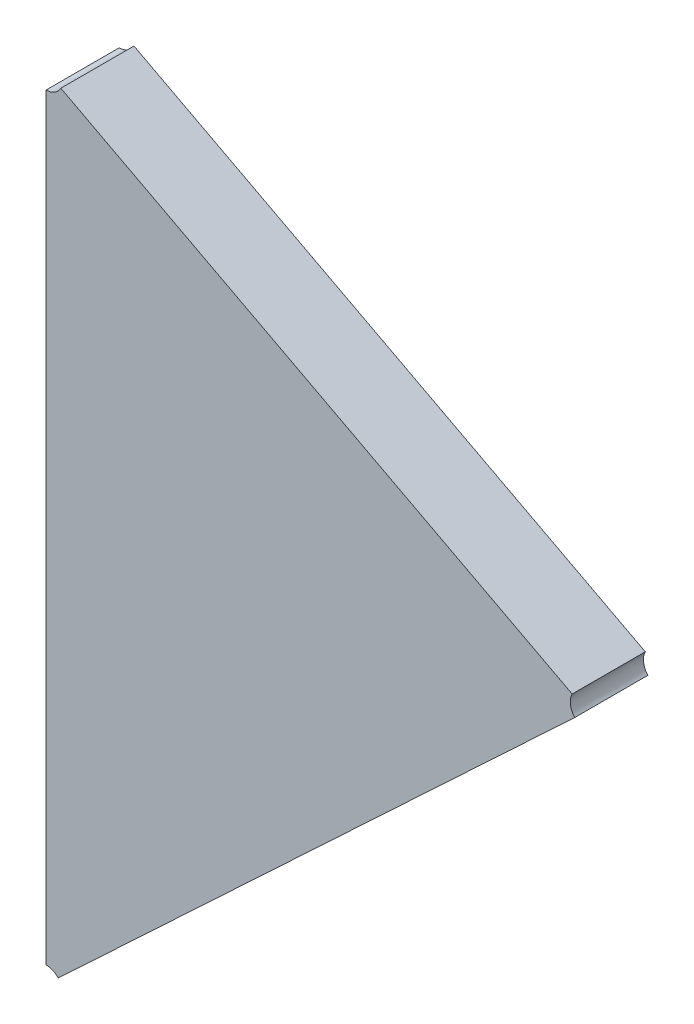
ISO-10303-21;
HEADER;
FILE_DESCRIPTION(('STEP AP214'),'2;1');
FILE_NAME('part.step','',(''),(''),'','','');
FILE_SCHEMA(('AUTOMOTIVE_DESIGN { 1 0 10303 214 1 1 1 1 }'));
ENDSEC;
DATA;
#1=APPLICATION_CONTEXT('core data for automotive mechanical design processes');
#2=APPLICATION_PROTOCOL_DEFINITION('international standard','automotive_design',2000,#1);
#3=PRODUCT_CONTEXT('',#1,'mechanical');
#4=PRODUCT('Part','Part','',(#3));
#5=PRODUCT_RELATED_PRODUCT_CATEGORY('part','',(#4));
#6=PRODUCT_DEFINITION_FORMATION('','',#4);
#7=PRODUCT_DEFINITION_CONTEXT('part definition',#1,'design');
#8=PRODUCT_DEFINITION('design','',#6,#7);
#9=PRODUCT_DEFINITION_SHAPE('','',#8);
#10=(LENGTH_UNIT() NAMED_UNIT(*) SI_UNIT(.MILLI.,.METRE.));
#11=(NAMED_UNIT(*) PLANE_ANGLE_UNIT() SI_UNIT($,.RADIAN.));
#12=(NAMED_UNIT(*) SI_UNIT($,.STERADIAN.) SOLID_ANGLE_UNIT());
#13=UNCERTAINTY_MEASURE_WITH_UNIT(LENGTH_MEASURE(1.E-05),#10,'distance_accuracy_value','');
#14=(GEOMETRIC_REPRESENTATION_CONTEXT(3) GLOBAL_UNCERTAINTY_ASSIGNED_CONTEXT((#13)) GLOBAL_UNIT_ASSIGNED_CONTEXT((#10,
#11,#12)) REPRESENTATION_CONTEXT('',''));
#15=CARTESIAN_POINT('',(0.,0.,0.));
#16=DIRECTION('',(0.,0.,1.));
#17=DIRECTION('',(1.,0.,0.));
#18=AXIS2_PLACEMENT_3D('',#15,#16,#17);
#19=CARTESIAN_POINT('',(-1.3474345448934,-1.308653002537,0.00415));
#20=DIRECTION('',(0.,0.,1.));
#21=DIRECTION('',(1.,0.,0.));
#22=AXIS2_PLACEMENT_3D('',#19,#20,#21);
#23=PLANE('',#22);
#24=CARTESIAN_POINT('',(-1.3551454031113,-1.327552967697,0.00415));
#25=DIRECTION('',(0.,0.,-1.));
#26=DIRECTION('',(-0.729821846781365,-0.683637383384377,0.));
#27=AXIS2_PLACEMENT_3D('',#24,#25,#26);
#28=CIRCLE('',#27,0.000749999999999995);
#29=CARTESIAN_POINT('',(-1.3551454031113,-1.326802967697,0.00415));
#30=VERTEX_POINT('',#29);
#31=CARTESIAN_POINT('',(-1.3545980367262,-1.3270402396594,0.00415));
#32=VERTEX_POINT('',#31);
#33=EDGE_CURVE('E11',#30,#32,#28,.T.);
#34=ORIENTED_EDGE('',*,*,#33,.T.);
#35=DIRECTION('',(0.72982184678132,0.683637383384425,0.));
#36=VECTOR('',#35,1.);
#37=CARTESIAN_POINT('',(-1.3545980367262,-1.3270402396594,0.00415));
#38=LINE('',#37,#36);
#39=CARTESIAN_POINT('',(-1.3312918133123,-1.3052088767569,0.00415));
#40=VERTEX_POINT('',#39);
#41=EDGE_CURVE('E24',#32,#40,#38,.T.);
#42=ORIENTED_EDGE('',*,*,#41,.T.);
#43=CARTESIAN_POINT('',(-1.3307444469272,-1.3046961487194,0.00415));
#44=DIRECTION('',(0.,0.,-1.));
#45=DIRECTION('',(0.885039467737754,-0.465515993867528,0.));
#46=AXIS2_PLACEMENT_3D('',#43,#44,#45);
#47=CIRCLE('',#46,0.000750000000000006);
#48=CARTESIAN_POINT('',(-1.331408226528,-1.304347011724,0.00415));
#49=VERTEX_POINT('',#48);
#50=EDGE_CURVE('E87',#40,#49,#47,.T.);
#51=ORIENTED_EDGE('',*,*,#50,.T.);
#52=DIRECTION('',(-0.885039467737862,0.465515993867324,0.));
#53=VECTOR('',#52,1.);
#54=CARTESIAN_POINT('',(-1.331408226528,-1.304347011724,0.00415));
#55=LINE('',#54,#53);
#56=CARTESIAN_POINT('',(-1.3544816235105,-1.292210789872,0.00415));
#57=VERTEX_POINT('',#56);
#58=EDGE_CURVE('E111',#49,#57,#55,.T.);
#59=ORIENTED_EDGE('',*,*,#58,.T.);
#60=CARTESIAN_POINT('',(-1.3551454031113,-1.2918616528766,0.00415));
#61=DIRECTION('',(0.,0.,-1.));
#62=DIRECTION('',(0.,1.,0.));
#63=AXIS2_PLACEMENT_3D('',#60,#61,#62);
#64=CIRCLE('',#63,0.00075000000000001);
#65=CARTESIAN_POINT('',(-1.3551454031113,-1.2926116528766,0.00415));
#66=VERTEX_POINT('',#65);
#67=EDGE_CURVE('E109',#57,#66,#64,.T.);
#68=ORIENTED_EDGE('',*,*,#67,.T.);
#69=DIRECTION('',(0.,-1.,0.));
#70=VECTOR('',#69,1.);
#71=CARTESIAN_POINT('',(-1.3551454031113,-1.2926116528766,0.00415));
#72=LINE('',#71,#70);
#73=EDGE_CURVE('E107',#66,#30,#72,.T.);
#74=ORIENTED_EDGE('',*,*,#73,.T.);
#75=EDGE_LOOP('',(#34,#42,#51,#59,#68,#74));
#76=FACE_BOUND('',#75,.T.);
#77=ADVANCED_FACE('F17',(#76),#23,.T.);
#78=CARTESIAN_POINT('',(-1.3474482291042,-1.3086676431187,0.00085));
#79=DIRECTION('',(0.,0.,-1.));
#80=DIRECTION('',(-1.,0.,0.));
#81=AXIS2_PLACEMENT_3D('',#78,#79,#80);
#82=PLANE('',#81);
#83=CARTESIAN_POINT('',(-1.3551454031113,-1.327552967697,0.00085));
#84=DIRECTION('',(0.,0.,1.));
#85=DIRECTION('',(-1.,0.,0.));
#86=AXIS2_PLACEMENT_3D('',#83,#84,#85);
#87=CIRCLE('',#86,0.000749999999999995);
#88=CARTESIAN_POINT('',(-1.3545980367262,-1.3270402396594,0.00085));
#89=VERTEX_POINT('',#88);
#90=CARTESIAN_POINT('',(-1.3551454031113,-1.326802967697,0.00085));
#91=VERTEX_POINT('',#90);
#92=EDGE_CURVE('E105',#89,#91,#87,.T.);
#93=ORIENTED_EDGE('',*,*,#92,.T.);
#94=DIRECTION('',(0.,1.,0.));
#95=VECTOR('',#94,1.);
#96=CARTESIAN_POINT('',(-1.3551454031113,-1.327552967697,0.00085));
#97=LINE('',#96,#95);
#98=CARTESIAN_POINT('',(-1.3551454031113,-1.2926116528766,0.00085));
#99=VERTEX_POINT('',#98);
#100=EDGE_CURVE('E103',#91,#99,#97,.T.);
#101=ORIENTED_EDGE('',*,*,#100,.T.);
#102=CARTESIAN_POINT('',(-1.3551454031113,-1.2918616528766,0.00085));
#103=DIRECTION('',(0.,0.,1.));
#104=DIRECTION('',(-1.,0.,0.));
#105=AXIS2_PLACEMENT_3D('',#102,#103,#104);
#106=CIRCLE('',#105,0.00075000000000001);
#107=CARTESIAN_POINT('',(-1.3544816235105,-1.292210789872,0.00085));
#108=VERTEX_POINT('',#107);
#109=EDGE_CURVE('E101',#99,#108,#106,.T.);
#110=ORIENTED_EDGE('',*,*,#109,.T.);
#111=DIRECTION('',(0.885039467737862,-0.465515993867324,0.));
#112=VECTOR('',#111,1.);
#113=CARTESIAN_POINT('',(-1.3551454031113,-1.2918616528766,0.00085));
#114=LINE('',#113,#112);
#115=CARTESIAN_POINT('',(-1.331408226528,-1.304347011724,0.00085));
#116=VERTEX_POINT('',#115);
#117=EDGE_CURVE('E72',#108,#116,#114,.T.);
#118=ORIENTED_EDGE('',*,*,#117,.T.);
#119=CARTESIAN_POINT('',(-1.3307444469272,-1.3046961487194,0.00085));
#120=DIRECTION('',(0.,0.,1.));
#121=DIRECTION('',(-1.,0.,0.));
#122=AXIS2_PLACEMENT_3D('',#119,#120,#121);
#123=CIRCLE('',#122,0.000750000000000006);
#124=CARTESIAN_POINT('',(-1.3312918133123,-1.3052088767569,0.00085));
#125=VERTEX_POINT('',#124);
#126=EDGE_CURVE('E66',#116,#125,#123,.T.);
#127=ORIENTED_EDGE('',*,*,#126,.T.);
#128=DIRECTION('',(-0.729821846781321,-0.683637383384425,0.));
#129=VECTOR('',#128,1.);
#130=CARTESIAN_POINT('',(-1.3307444469272,-1.3046961487194,0.00085));
#131=LINE('',#130,#129);
#132=EDGE_CURVE('E69',#125,#89,#131,.T.);
#133=ORIENTED_EDGE('',*,*,#132,.T.);
#134=EDGE_LOOP('',(#93,#101,#110,#118,#127,#133));
#135=FACE_BOUND('',#134,.T.);
#136=ADVANCED_FACE('F68',(#135),#82,.T.);
#137=CARTESIAN_POINT('',(-1.3551454031113,-1.2918616528766,0.00085));
#138=DIRECTION('',(-0.465515993867324,-0.885039467737862,0.));
#139=DIRECTION('',(0.885039467737862,-0.465515993867324,0.));
#140=AXIS2_PLACEMENT_3D('',#137,#138,#139);
#141=PLANE('',#140);
#142=DIRECTION('',(0.,0.,-1.));
#143=VECTOR('',#142,1.);
#144=CARTESIAN_POINT('',(-1.331408226528,-1.304347011724,0.00115));
#145=LINE('',#144,#143);
#146=EDGE_CURVE('E83',#49,#116,#145,.T.);
#147=ORIENTED_EDGE('',*,*,#146,.T.);
#148=ORIENTED_EDGE('',*,*,#117,.F.);
#149=DIRECTION('',(0.,0.,1.));
#150=VECTOR('',#149,1.);
#151=CARTESIAN_POINT('',(-1.3544816235105,-1.292210789872,0.00115));
#152=LINE('',#151,#150);
#153=EDGE_CURVE('E90',#108,#57,#152,.T.);
#154=ORIENTED_EDGE('',*,*,#153,.T.);
#155=ORIENTED_EDGE('',*,*,#58,.F.);
#156=EDGE_LOOP('',(#147,#148,#154,#155));
#157=FACE_BOUND('',#156,.T.);
#158=ADVANCED_FACE('F127',(#157),#141,.F.);
#159=CARTESIAN_POINT('',(-1.3307444469272,-1.3046961487194,0.00085));
#160=DIRECTION('',(-0.683637383384425,0.729821846781321,0.));
#161=DIRECTION('',(-0.729821846781321,-0.683637383384425,0.));
#162=AXIS2_PLACEMENT_3D('',#159,#160,#161);
#163=PLANE('',#162);
#164=DIRECTION('',(0.,0.,-1.));
#165=VECTOR('',#164,1.);
#166=CARTESIAN_POINT('',(-1.3545980367262,-1.3270402396594,0.00115));
#167=LINE('',#166,#165);
#168=EDGE_CURVE('E82',#32,#89,#167,.T.);
#169=ORIENTED_EDGE('',*,*,#168,.T.);
#170=ORIENTED_EDGE('',*,*,#132,.F.);
#171=DIRECTION('',(0.,0.,1.));
#172=VECTOR('',#171,1.);
#173=CARTESIAN_POINT('',(-1.3312918133123,-1.3052088767569,0.00115));
#174=LINE('',#173,#172);
#175=EDGE_CURVE('E81',#125,#40,#174,.T.);
#176=ORIENTED_EDGE('',*,*,#175,.T.);
#177=ORIENTED_EDGE('',*,*,#41,.F.);
#178=EDGE_LOOP('',(#169,#170,#176,#177));
#179=FACE_BOUND('',#178,.T.);
#180=ADVANCED_FACE('F80',(#179),#163,.F.);
#181=CARTESIAN_POINT('',(-1.3551454031113,-1.327552967697,0.00085));
#182=DIRECTION('',(1.,0.,0.));
#183=DIRECTION('',(0.,1.,0.));
#184=AXIS2_PLACEMENT_3D('',#181,#182,#183);
#185=PLANE('',#184);
#186=DIRECTION('',(0.,0.,1.));
#187=VECTOR('',#186,1.);
#188=CARTESIAN_POINT('',(-1.3551454031113,-1.326802967697,0.00115));
#189=LINE('',#188,#187);
#190=EDGE_CURVE('E88',#91,#30,#189,.T.);
#191=ORIENTED_EDGE('',*,*,#190,.T.);
#192=ORIENTED_EDGE('',*,*,#73,.F.);
#193=DIRECTION('',(0.,0.,1.));
#194=VECTOR('',#193,1.);
#195=CARTESIAN_POINT('',(-1.3551454031113,-1.2926116528766,0.00115));
#196=LINE('',#195,#194);
#197=EDGE_CURVE('E93',#99,#66,#196,.T.);
#198=ORIENTED_EDGE('',*,*,#197,.F.);
#199=ORIENTED_EDGE('',*,*,#100,.F.);
#200=EDGE_LOOP('',(#191,#192,#198,#199));
#201=FACE_BOUND('',#200,.T.);
#202=ADVANCED_FACE('F119',(#201),#185,.F.);
#203=CARTESIAN_POINT('',(-1.3551454031113,-1.2918616528766,0.00115));
#204=DIRECTION('',(0.,0.,1.));
#205=DIRECTION('',(-1.,0.,0.));
#206=AXIS2_PLACEMENT_3D('',#203,#204,#205);
#207=CYLINDRICAL_SURFACE('',#206,0.00075000000000001);
#208=ORIENTED_EDGE('',*,*,#153,.F.);
#209=ORIENTED_EDGE('',*,*,#109,.F.);
#210=ORIENTED_EDGE('',*,*,#197,.T.);
#211=ORIENTED_EDGE('',*,*,#67,.F.);
#212=EDGE_LOOP('',(#208,#209,#210,#211));
#213=FACE_BOUND('',#212,.T.);
#214=ADVANCED_FACE('F125',(#213),#207,.F.);
#215=CARTESIAN_POINT('',(-1.3307444469272,-1.3046961487194,0.00115));
#216=DIRECTION('',(0.,0.,1.));
#217=DIRECTION('',(-1.,0.,0.));
#218=AXIS2_PLACEMENT_3D('',#215,#216,#217);
#219=CYLINDRICAL_SURFACE('',#218,0.000750000000000006);
#220=ORIENTED_EDGE('',*,*,#146,.F.);
#221=ORIENTED_EDGE('',*,*,#50,.F.);
#222=ORIENTED_EDGE('',*,*,#175,.F.);
#223=ORIENTED_EDGE('',*,*,#126,.F.);
#224=EDGE_LOOP('',(#220,#221,#222,#223));
#225=FACE_BOUND('',#224,.T.);
#226=ADVANCED_FACE('F86',(#225),#219,.F.);
#227=CARTESIAN_POINT('',(-1.3551454031113,-1.327552967697,0.00115));
#228=DIRECTION('',(0.,0.,1.));
#229=DIRECTION('',(-1.,0.,0.));
#230=AXIS2_PLACEMENT_3D('',#227,#228,#229);
#231=CYLINDRICAL_SURFACE('',#230,0.000749999999999995);
#232=ORIENTED_EDGE('',*,*,#168,.F.);
#233=ORIENTED_EDGE('',*,*,#33,.F.);
#234=ORIENTED_EDGE('',*,*,#190,.F.);
#235=ORIENTED_EDGE('',*,*,#92,.F.);
#236=EDGE_LOOP('',(#232,#233,#234,#235));
#237=FACE_BOUND('',#236,.T.);
#238=ADVANCED_FACE('F114',(#237),#231,.F.);
#239=CLOSED_SHELL('',(#77,#136,#158,#180,#202,#214,#226,#238));
#240=MANIFOLD_SOLID_BREP('B1',#239);
#241=ADVANCED_BREP_SHAPE_REPRESENTATION('',(#18,#240),#14);
#242=SHAPE_DEFINITION_REPRESENTATION(#9,#241);
ENDSEC;
END-ISO-10303-21;
